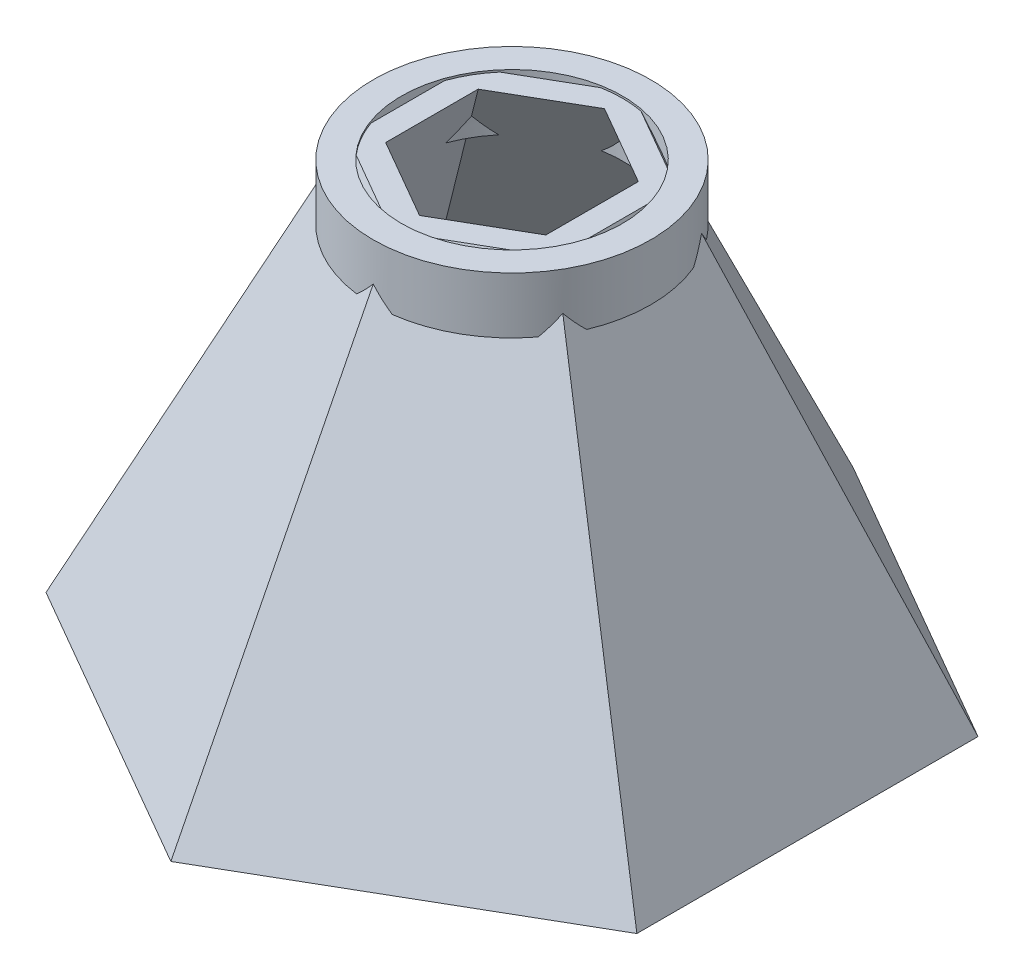
ISO-10303-21;
HEADER;
FILE_DESCRIPTION(('STEP AP214'),'2;1');
FILE_NAME('part.step','',(''),(''),'','','');
FILE_SCHEMA(('AUTOMOTIVE_DESIGN { 1 0 10303 214 1 1 1 1 }'));
ENDSEC;
DATA;
#1=APPLICATION_CONTEXT('core data for automotive mechanical design processes');
#2=APPLICATION_PROTOCOL_DEFINITION('international standard','automotive_design',2000,#1);
#3=PRODUCT_CONTEXT('',#1,'mechanical');
#4=PRODUCT('Part','Part','',(#3));
#5=PRODUCT_RELATED_PRODUCT_CATEGORY('part','',(#4));
#6=PRODUCT_DEFINITION_FORMATION('','',#4);
#7=PRODUCT_DEFINITION_CONTEXT('part definition',#1,'design');
#8=PRODUCT_DEFINITION('design','',#6,#7);
#9=PRODUCT_DEFINITION_SHAPE('','',#8);
#10=(LENGTH_UNIT() NAMED_UNIT(*) SI_UNIT(.MILLI.,.METRE.));
#11=(NAMED_UNIT(*) PLANE_ANGLE_UNIT() SI_UNIT($,.RADIAN.));
#12=(NAMED_UNIT(*) SI_UNIT($,.STERADIAN.) SOLID_ANGLE_UNIT());
#13=UNCERTAINTY_MEASURE_WITH_UNIT(LENGTH_MEASURE(1.E-05),#10,'distance_accuracy_value','');
#14=(GEOMETRIC_REPRESENTATION_CONTEXT(3) GLOBAL_UNCERTAINTY_ASSIGNED_CONTEXT((#13)) GLOBAL_UNIT_ASSIGNED_CONTEXT((#10,
#11,#12)) REPRESENTATION_CONTEXT('',''));
#15=CARTESIAN_POINT('',(0.,0.,0.));
#16=DIRECTION('',(0.,0.,1.));
#17=DIRECTION('',(1.,0.,0.));
#18=AXIS2_PLACEMENT_3D('',#15,#16,#17);
#19=CARTESIAN_POINT('',(0.,-7.112,0.));
#20=DIRECTION('',(0.,1.,0.));
#21=DIRECTION('',(0.,0.,1.));
#22=AXIS2_PLACEMENT_3D('',#19,#20,#21);
#23=PLANE('',#22);
#24=CARTESIAN_POINT('',(0.,-7.112,0.));
#25=DIRECTION('',(0.,1.,0.));
#26=DIRECTION('',(0.,0.,1.));
#27=AXIS2_PLACEMENT_3D('',#24,#25,#26);
#28=CIRCLE('',#27,17.5390809388236);
#29=CARTESIAN_POINT('',(16.1880782558161,-7.112,6.75022092691629));
#30=VERTEX_POINT('',#29);
#31=CARTESIAN_POINT('',(16.1880782558161,-7.112,-6.7502209269163));
#32=VERTEX_POINT('',#31);
#33=EDGE_CURVE('E590',#30,#32,#28,.T.);
#34=ORIENTED_EDGE('',*,*,#33,.F.);
#35=DIRECTION('',(0.,0.,-1.));
#36=VECTOR('',#35,1.);
#37=CARTESIAN_POINT('',(16.1880782558161,-7.112,0.));
#38=LINE('',#37,#36);
#39=EDGE_CURVE('E572',#30,#32,#38,.T.);
#40=ORIENTED_EDGE('',*,*,#39,.T.);
#41=EDGE_LOOP('',(#34,#40));
#42=FACE_BOUND('',#41,.T.);
#43=ADVANCED_FACE('F49',(#42),#23,.F.);
#44=CARTESIAN_POINT('',(2.2481763240412,-7.112,17.3943974714454));
#45=VERTEX_POINT('',#44);
#46=CARTESIAN_POINT('',(13.9399019317749,-7.112,10.6441765445291));
#47=VERTEX_POINT('',#46);
#48=EDGE_CURVE('E586',#45,#47,#28,.T.);
#49=ORIENTED_EDGE('',*,*,#48,.F.);
#50=DIRECTION('',(0.866025403784439,0.,-0.5));
#51=VECTOR('',#50,1.);
#52=CARTESIAN_POINT('',(8.09403912790805,-7.112,14.0192870079872));
#53=LINE('',#52,#51);
#54=EDGE_CURVE('E566',#45,#47,#53,.T.);
#55=ORIENTED_EDGE('',*,*,#54,.T.);
#56=EDGE_LOOP('',(#49,#55));
#57=FACE_BOUND('',#56,.T.);
#58=ADVANCED_FACE('F730',(#57),#23,.F.);
#59=CARTESIAN_POINT('',(13.9399019317749,-7.112,-10.6441765445291));
#60=VERTEX_POINT('',#59);
#61=CARTESIAN_POINT('',(2.2481763240412,-7.112,-17.3943974714454));
#62=VERTEX_POINT('',#61);
#63=EDGE_CURVE('E812',#60,#62,#28,.T.);
#64=ORIENTED_EDGE('',*,*,#63,.F.);
#65=DIRECTION('',(-0.866025403784438,0.,-0.5));
#66=VECTOR('',#65,1.);
#67=CARTESIAN_POINT('',(8.09403912790805,-7.112,-14.0192870079872));
#68=LINE('',#67,#66);
#69=EDGE_CURVE('E560',#60,#62,#68,.T.);
#70=ORIENTED_EDGE('',*,*,#69,.T.);
#71=EDGE_LOOP('',(#64,#70));
#72=FACE_BOUND('',#71,.T.);
#73=ADVANCED_FACE('F737',(#72),#23,.F.);
#74=CARTESIAN_POINT('',(-2.24817632404119,-7.112,-17.3943974714454));
#75=VERTEX_POINT('',#74);
#76=CARTESIAN_POINT('',(-13.9399019317749,-7.112,-10.6441765445291));
#77=VERTEX_POINT('',#76);
#78=EDGE_CURVE('E810',#75,#77,#28,.T.);
#79=ORIENTED_EDGE('',*,*,#78,.F.);
#80=DIRECTION('',(-0.866025403784439,0.,0.5));
#81=VECTOR('',#80,1.);
#82=CARTESIAN_POINT('',(-8.09403912790804,-7.112,-14.0192870079872));
#83=LINE('',#82,#81);
#84=EDGE_CURVE('E554',#75,#77,#83,.T.);
#85=ORIENTED_EDGE('',*,*,#84,.T.);
#86=EDGE_LOOP('',(#79,#85));
#87=FACE_BOUND('',#86,.T.);
#88=ADVANCED_FACE('F799',(#87),#23,.F.);
#89=CARTESIAN_POINT('',(-16.1880782558161,-7.112,-6.7502209269163));
#90=VERTEX_POINT('',#89);
#91=CARTESIAN_POINT('',(-16.1880782558161,-7.112,6.75022092691629));
#92=VERTEX_POINT('',#91);
#93=EDGE_CURVE('E807',#90,#92,#28,.T.);
#94=ORIENTED_EDGE('',*,*,#93,.F.);
#95=DIRECTION('',(0.,0.,1.));
#96=VECTOR('',#95,1.);
#97=CARTESIAN_POINT('',(-16.1880782558161,-7.112,0.));
#98=LINE('',#97,#96);
#99=EDGE_CURVE('E548',#90,#92,#98,.T.);
#100=ORIENTED_EDGE('',*,*,#99,.T.);
#101=EDGE_LOOP('',(#94,#100));
#102=FACE_BOUND('',#101,.T.);
#103=ADVANCED_FACE('F750',(#102),#23,.F.);
#104=CARTESIAN_POINT('',(0.,-7.112,0.));
#105=DIRECTION('',(0.,1.,0.));
#106=DIRECTION('',(0.,0.,1.));
#107=AXIS2_PLACEMENT_3D('',#104,#105,#106);
#108=CYLINDRICAL_SURFACE('',#107,17.5390809388236);
#109=CARTESIAN_POINT('',(0.,29.7290520631807,0.));
#110=DIRECTION('',(0.915516312442047,0.402280849224165,0.));
#111=DIRECTION('',(-0.402280849224165,0.915516312442047,0.));
#112=AXIS2_PLACEMENT_3D('',#109,#110,#111);
#113=ELLIPSE('',#112,43.5990949423748,17.5390809388236);
#114=CARTESIAN_POINT('',(15.1892896520526,-4.83894310159141,8.76954046941178));
#115=VERTEX_POINT('',#114);
#116=EDGE_CURVE('E575',#30,#115,#113,.F.);
#117=ORIENTED_EDGE('',*,*,#116,.F.);
#118=ORIENTED_EDGE('',*,*,#33,.T.);
#119=CARTESIAN_POINT('',(15.1892896520526,-4.83894310159141,-8.76954046941178));
#120=VERTEX_POINT('',#119);
#121=EDGE_CURVE('E577',#120,#32,#113,.F.);
#122=ORIENTED_EDGE('',*,*,#121,.F.);
#123=CARTESIAN_POINT('',(0.,29.7290520631807,0.));
#124=DIRECTION('',(0.457758156221024,0.402280849224166,-0.792860384153864));
#125=DIRECTION('',(-0.201140424612083,0.915516312442047,0.348385434884105));
#126=AXIS2_PLACEMENT_3D('',#123,#124,#125);
#127=ELLIPSE('',#126,43.5990949423748,17.5390809388236);
#128=EDGE_CURVE('E563',#60,#120,#127,.F.);
#129=ORIENTED_EDGE('',*,*,#128,.F.);
#130=ORIENTED_EDGE('',*,*,#63,.T.);
#131=CARTESIAN_POINT('',(0.,-4.83894310159141,-17.5390809388236));
#132=VERTEX_POINT('',#131);
#133=EDGE_CURVE('E565',#132,#62,#127,.F.);
#134=ORIENTED_EDGE('',*,*,#133,.F.);
#135=CARTESIAN_POINT('',(0.,29.7290520631807,0.));
#136=DIRECTION('',(-0.457758156221024,0.402280849224165,-0.792860384153864));
#137=DIRECTION('',(0.201140424612083,0.915516312442047,0.348385434884105));
#138=AXIS2_PLACEMENT_3D('',#135,#136,#137);
#139=ELLIPSE('',#138,43.5990949423748,17.5390809388236);
#140=EDGE_CURVE('E557',#75,#132,#139,.F.);
#141=ORIENTED_EDGE('',*,*,#140,.F.);
#142=ORIENTED_EDGE('',*,*,#78,.T.);
#143=CARTESIAN_POINT('',(-15.1892896520526,-4.83894310159141,-8.76954046941179));
#144=VERTEX_POINT('',#143);
#145=EDGE_CURVE('E559',#144,#77,#139,.F.);
#146=ORIENTED_EDGE('',*,*,#145,.F.);
#147=CARTESIAN_POINT('',(0.,29.7290520631807,0.));
#148=DIRECTION('',(-0.915516312442047,0.402280849224165,0.));
#149=DIRECTION('',(0.402280849224165,0.915516312442048,0.));
#150=AXIS2_PLACEMENT_3D('',#147,#148,#149);
#151=ELLIPSE('',#150,43.5990949423749,17.5390809388236);
#152=EDGE_CURVE('E551',#90,#144,#151,.F.);
#153=ORIENTED_EDGE('',*,*,#152,.F.);
#154=ORIENTED_EDGE('',*,*,#93,.T.);
#155=CARTESIAN_POINT('',(-15.1892896520526,-4.83894310159142,8.76954046941178));
#156=VERTEX_POINT('',#155);
#157=EDGE_CURVE('E553',#156,#92,#151,.F.);
#158=ORIENTED_EDGE('',*,*,#157,.F.);
#159=CARTESIAN_POINT('',(0.,29.7290520631807,0.));
#160=DIRECTION('',(-0.457758156221024,0.402280849224165,0.792860384153864));
#161=DIRECTION('',(0.201140424612083,0.915516312442047,-0.348385434884105));
#162=AXIS2_PLACEMENT_3D('',#159,#160,#161);
#163=ELLIPSE('',#162,43.5990949423749,17.5390809388236);
#164=CARTESIAN_POINT('',(-13.9399019317749,-7.112,10.6441765445291));
#165=VERTEX_POINT('',#164);
#166=EDGE_CURVE('E545',#165,#156,#163,.F.);
#167=ORIENTED_EDGE('',*,*,#166,.F.);
#168=CARTESIAN_POINT('',(-2.2481763240412,-7.112,17.3943974714454));
#169=VERTEX_POINT('',#168);
#170=EDGE_CURVE('E591',#165,#169,#28,.T.);
#171=ORIENTED_EDGE('',*,*,#170,.T.);
#172=CARTESIAN_POINT('',(0.,-4.83894310159139,17.5390809388236));
#173=VERTEX_POINT('',#172);
#174=EDGE_CURVE('E547',#173,#169,#163,.F.);
#175=ORIENTED_EDGE('',*,*,#174,.F.);
#176=CARTESIAN_POINT('',(0.,29.7290520631807,0.));
#177=DIRECTION('',(0.457758156221024,0.402280849224165,0.792860384153864));
#178=DIRECTION('',(-0.201140424612083,0.915516312442047,-0.348385434884105));
#179=AXIS2_PLACEMENT_3D('',#176,#177,#178);
#180=ELLIPSE('',#179,43.5990949423748,17.5390809388236);
#181=EDGE_CURVE('E569',#45,#173,#180,.F.);
#182=ORIENTED_EDGE('',*,*,#181,.F.);
#183=ORIENTED_EDGE('',*,*,#48,.T.);
#184=EDGE_CURVE('E571',#115,#47,#180,.F.);
#185=ORIENTED_EDGE('',*,*,#184,.F.);
#186=EDGE_LOOP('',(#117,#118,#122,#129,#130,#134,#141,#142,#146,#153,#154,#158,#167,#171,#175,
#182,#183,#185));
#187=FACE_BOUND('',#186,.T.);
#188=CARTESIAN_POINT('',(0.,0.,0.));
#189=DIRECTION('',(0.,1.,0.));
#190=DIRECTION('',(0.,0.,1.));
#191=AXIS2_PLACEMENT_3D('',#188,#189,#190);
#192=CIRCLE('',#191,17.5390809388236);
#193=CARTESIAN_POINT('',(0.,0.,17.5390809388236));
#194=VERTEX_POINT('',#193);
#195=EDGE_CURVE('E592',#194,#194,#192,.T.);
#196=ORIENTED_EDGE('',*,*,#195,.F.);
#197=EDGE_LOOP('',(#196));
#198=FACE_BOUND('',#197,.T.);
#199=ADVANCED_FACE('F51',(#187,#198),#108,.T.);
#200=ORIENTED_EDGE('',*,*,#170,.F.);
#201=DIRECTION('',(0.866025403784438,0.,0.5));
#202=VECTOR('',#201,1.);
#203=CARTESIAN_POINT('',(-8.09403912790804,-7.112,14.0192870079872));
#204=LINE('',#203,#202);
#205=EDGE_CURVE('E541',#165,#169,#204,.T.);
#206=ORIENTED_EDGE('',*,*,#205,.T.);
#207=EDGE_LOOP('',(#200,#206));
#208=FACE_BOUND('',#207,.T.);
#209=ADVANCED_FACE('F733',(#208),#23,.F.);
#210=CARTESIAN_POINT('',(0.,0.,0.));
#211=DIRECTION('',(0.,1.,0.));
#212=DIRECTION('',(0.,0.,1.));
#213=AXIS2_PLACEMENT_3D('',#210,#211,#212);
#214=PLANE('',#213);
#215=CARTESIAN_POINT('',(0.,0.,0.));
#216=DIRECTION('',(0.,1.,0.));
#217=DIRECTION('',(0.,0.,1.));
#218=AXIS2_PLACEMENT_3D('',#215,#216,#217);
#219=CIRCLE('',#218,13.97);
#220=CARTESIAN_POINT('',(0.,0.,13.97));
#221=VERTEX_POINT('',#220);
#222=EDGE_CURVE('E582',#221,#221,#219,.T.);
#223=ORIENTED_EDGE('',*,*,#222,.F.);
#224=EDGE_LOOP('',(#223));
#225=FACE_BOUND('',#224,.T.);
#226=ORIENTED_EDGE('',*,*,#195,.T.);
#227=EDGE_LOOP('',(#226));
#228=FACE_BOUND('',#227,.T.);
#229=ADVANCED_FACE('F742',(#225,#228),#214,.T.);
#230=CARTESIAN_POINT('',(0.,-7.112,0.));
#231=DIRECTION('',(0.,1.,0.));
#232=DIRECTION('',(0.,0.,1.));
#233=AXIS2_PLACEMENT_3D('',#230,#231,#232);
#234=CYLINDRICAL_SURFACE('',#233,13.97);
#235=CARTESIAN_POINT('',(0.,-0.254,0.));
#236=DIRECTION('',(0.,-1.,0.));
#237=DIRECTION('',(0.,0.,-1.));
#238=AXIS2_PLACEMENT_3D('',#235,#236,#237);
#239=CIRCLE('',#238,13.97);
#240=CARTESIAN_POINT('',(2.56338341614084,-0.254,-13.7328061757914));
#241=VERTEX_POINT('',#240);
#242=CARTESIAN_POINT('',(-2.56338341614084,-0.254,-13.7328061757914));
#243=VERTEX_POINT('',#242);
#244=EDGE_CURVE('E634',#241,#243,#239,.F.);
#245=ORIENTED_EDGE('',*,*,#244,.F.);
#246=CARTESIAN_POINT('',(0.,29.7290520631807,0.));
#247=DIRECTION('',(0.457758156221024,0.402280849224166,-0.792860384153864));
#248=DIRECTION('',(-0.201140424612083,0.915516312442047,0.348385434884105));
#249=AXIS2_PLACEMENT_3D('',#246,#247,#248);
#250=ELLIPSE('',#249,34.7269824724254,13.97);
#251=CARTESIAN_POINT('',(10.6112673054128,-0.254,-9.0863582459134));
#252=VERTEX_POINT('',#251);
#253=EDGE_CURVE('E12',#241,#252,#250,.F.);
#254=ORIENTED_EDGE('',*,*,#253,.T.);
#255=CARTESIAN_POINT('',(13.1746507215536,-0.254,-4.646447929878));
#256=VERTEX_POINT('',#255);
#257=EDGE_CURVE('E57',#256,#252,#239,.F.);
#258=ORIENTED_EDGE('',*,*,#257,.F.);
#259=CARTESIAN_POINT('',(0.,29.7290520631807,0.));
#260=DIRECTION('',(0.915516312442047,0.402280849224165,0.));
#261=DIRECTION('',(-0.402280849224165,0.915516312442047,0.));
#262=AXIS2_PLACEMENT_3D('',#259,#260,#261);
#263=ELLIPSE('',#262,34.7269824724254,13.97);
#264=CARTESIAN_POINT('',(13.1746507215536,-0.254,4.64644792987799));
#265=VERTEX_POINT('',#264);
#266=EDGE_CURVE('E631',#256,#265,#263,.F.);
#267=ORIENTED_EDGE('',*,*,#266,.T.);
#268=CARTESIAN_POINT('',(10.6112673054127,-0.254,9.0863582459134));
#269=VERTEX_POINT('',#268);
#270=EDGE_CURVE('E628',#269,#265,#239,.F.);
#271=ORIENTED_EDGE('',*,*,#270,.F.);
#272=CARTESIAN_POINT('',(0.,29.7290520631807,0.));
#273=DIRECTION('',(0.457758156221024,0.402280849224165,0.792860384153864));
#274=DIRECTION('',(-0.201140424612083,0.915516312442047,-0.348385434884105));
#275=AXIS2_PLACEMENT_3D('',#272,#273,#274);
#276=ELLIPSE('',#275,34.7269824724254,13.97);
#277=CARTESIAN_POINT('',(2.56338341614085,-0.254,13.7328061757914));
#278=VERTEX_POINT('',#277);
#279=EDGE_CURVE('E625',#269,#278,#276,.F.);
#280=ORIENTED_EDGE('',*,*,#279,.T.);
#281=CARTESIAN_POINT('',(-2.56338341614085,-0.254,13.7328061757914));
#282=VERTEX_POINT('',#281);
#283=EDGE_CURVE('E619',#282,#278,#239,.F.);
#284=ORIENTED_EDGE('',*,*,#283,.F.);
#285=CARTESIAN_POINT('',(0.,29.7290520631807,0.));
#286=DIRECTION('',(-0.457758156221024,0.402280849224165,0.792860384153864));
#287=DIRECTION('',(0.201140424612083,0.915516312442047,-0.348385434884105));
#288=AXIS2_PLACEMENT_3D('',#285,#286,#287);
#289=ELLIPSE('',#288,34.7269824724254,13.97);
#290=CARTESIAN_POINT('',(-10.6112673054127,-0.254,9.0863582459134));
#291=VERTEX_POINT('',#290);
#292=EDGE_CURVE('E616',#282,#291,#289,.F.);
#293=ORIENTED_EDGE('',*,*,#292,.T.);
#294=CARTESIAN_POINT('',(-13.1746507215536,-0.254,4.64644792987797));
#295=VERTEX_POINT('',#294);
#296=EDGE_CURVE('E621',#295,#291,#239,.F.);
#297=ORIENTED_EDGE('',*,*,#296,.F.);
#298=CARTESIAN_POINT('',(0.,29.7290520631807,0.));
#299=DIRECTION('',(-0.915516312442047,0.402280849224165,0.));
#300=DIRECTION('',(0.402280849224165,0.915516312442048,0.));
#301=AXIS2_PLACEMENT_3D('',#298,#299,#300);
#302=ELLIPSE('',#301,34.7269824724254,13.97);
#303=CARTESIAN_POINT('',(-13.1746507215536,-0.254,-4.64644792987799));
#304=VERTEX_POINT('',#303);
#305=EDGE_CURVE('E622',#295,#304,#302,.F.);
#306=ORIENTED_EDGE('',*,*,#305,.T.);
#307=CARTESIAN_POINT('',(-10.6112673054128,-0.254,-9.0863582459134));
#308=VERTEX_POINT('',#307);
#309=EDGE_CURVE('E632',#308,#304,#239,.F.);
#310=ORIENTED_EDGE('',*,*,#309,.F.);
#311=CARTESIAN_POINT('',(0.,29.7290520631807,0.));
#312=DIRECTION('',(-0.457758156221024,0.402280849224165,-0.792860384153864));
#313=DIRECTION('',(0.201140424612083,0.915516312442047,0.348385434884105));
#314=AXIS2_PLACEMENT_3D('',#311,#312,#313);
#315=ELLIPSE('',#314,34.7269824724254,13.97);
#316=EDGE_CURVE('E629',#308,#243,#315,.F.);
#317=ORIENTED_EDGE('',*,*,#316,.T.);
#318=EDGE_LOOP('',(#245,#254,#258,#267,#271,#280,#284,#293,#297,#306,#310,#317));
#319=FACE_BOUND('',#318,.T.);
#320=ORIENTED_EDGE('',*,*,#222,.T.);
#321=EDGE_LOOP('',(#320));
#322=FACE_BOUND('',#321,.T.);
#323=ADVANCED_FACE('F655',(#319,#322),#234,.F.);
#324=CARTESIAN_POINT('',(0.,-0.254,0.));
#325=DIRECTION('',(0.,-1.,0.));
#326=DIRECTION('',(0.,0.,-1.));
#327=AXIS2_PLACEMENT_3D('',#324,#325,#326);
#328=PLANE('',#327);
#329=DIRECTION('',(-0.866025403784438,0.,-0.5));
#330=VECTOR('',#329,1.);
#331=CARTESIAN_POINT('',(0.,-0.254,11.6888267235082));
#332=LINE('',#331,#330);
#333=CARTESIAN_POINT('',(0.,-0.254,11.6888267235082));
#334=VERTEX_POINT('',#333);
#335=CARTESIAN_POINT('',(-10.1228208829926,-0.254,5.84441336175412));
#336=VERTEX_POINT('',#335);
#337=EDGE_CURVE('E314',#334,#336,#332,.T.);
#338=ORIENTED_EDGE('',*,*,#337,.T.);
#339=DIRECTION('',(0.,0.,-1.));
#340=VECTOR('',#339,1.);
#341=CARTESIAN_POINT('',(-10.1228208829926,-0.254,5.84441336175412));
#342=LINE('',#341,#340);
#343=CARTESIAN_POINT('',(-10.1228208829926,-0.254,-5.84441336175413));
#344=VERTEX_POINT('',#343);
#345=EDGE_CURVE('E423',#336,#344,#342,.T.);
#346=ORIENTED_EDGE('',*,*,#345,.T.);
#347=DIRECTION('',(0.866025403784439,0.,-0.5));
#348=VECTOR('',#347,1.);
#349=CARTESIAN_POINT('',(-10.1228208829926,-0.254,-5.84441336175413));
#350=LINE('',#349,#348);
#351=CARTESIAN_POINT('',(0.,-0.254,-11.6888267235083));
#352=VERTEX_POINT('',#351);
#353=EDGE_CURVE('E420',#344,#352,#350,.T.);
#354=ORIENTED_EDGE('',*,*,#353,.T.);
#355=DIRECTION('',(0.866025403784439,0.,0.5));
#356=VECTOR('',#355,1.);
#357=CARTESIAN_POINT('',(0.,-0.254,-11.6888267235083));
#358=LINE('',#357,#356);
#359=CARTESIAN_POINT('',(10.1228208829926,-0.254,-5.84441336175412));
#360=VERTEX_POINT('',#359);
#361=EDGE_CURVE('E410',#352,#360,#358,.T.);
#362=ORIENTED_EDGE('',*,*,#361,.T.);
#363=DIRECTION('',(0.,0.,1.));
#364=VECTOR('',#363,1.);
#365=CARTESIAN_POINT('',(10.1228208829926,-0.254,-5.84441336175412));
#366=LINE('',#365,#364);
#367=CARTESIAN_POINT('',(10.1228208829926,-0.254,5.84441336175412));
#368=VERTEX_POINT('',#367);
#369=EDGE_CURVE('E406',#360,#368,#366,.T.);
#370=ORIENTED_EDGE('',*,*,#369,.T.);
#371=DIRECTION('',(-0.866025403784439,0.,0.5));
#372=VECTOR('',#371,1.);
#373=CARTESIAN_POINT('',(10.1228208829926,-0.254,5.84441336175412));
#374=LINE('',#373,#372);
#375=EDGE_CURVE('E401',#368,#334,#374,.T.);
#376=ORIENTED_EDGE('',*,*,#375,.T.);
#377=EDGE_LOOP('',(#338,#346,#354,#362,#370,#376));
#378=FACE_BOUND('',#377,.T.);
#379=DIRECTION('',(0.866025403784439,0.,-0.5));
#380=VECTOR('',#379,1.);
#381=CARTESIAN_POINT('',(-6.5873253607768,-0.254,-11.4095822108524));
#382=LINE('',#381,#380);
#383=EDGE_CURVE('E660',#308,#243,#382,.T.);
#384=ORIENTED_EDGE('',*,*,#383,.F.);
#385=ORIENTED_EDGE('',*,*,#309,.T.);
#386=DIRECTION('',(0.,0.,-1.));
#387=VECTOR('',#386,1.);
#388=CARTESIAN_POINT('',(-13.1746507215536,-0.254,0.));
#389=LINE('',#388,#387);
#390=EDGE_CURVE('E654',#295,#304,#389,.T.);
#391=ORIENTED_EDGE('',*,*,#390,.F.);
#392=ORIENTED_EDGE('',*,*,#296,.T.);
#393=DIRECTION('',(-0.866025403784438,0.,-0.5));
#394=VECTOR('',#393,1.);
#395=CARTESIAN_POINT('',(-6.5873253607768,-0.254,11.4095822108524));
#396=LINE('',#395,#394);
#397=EDGE_CURVE('E652',#282,#291,#396,.T.);
#398=ORIENTED_EDGE('',*,*,#397,.F.);
#399=ORIENTED_EDGE('',*,*,#283,.T.);
#400=DIRECTION('',(-0.866025403784439,0.,0.5));
#401=VECTOR('',#400,1.);
#402=CARTESIAN_POINT('',(6.5873253607768,-0.254,11.4095822108524));
#403=LINE('',#402,#401);
#404=EDGE_CURVE('E667',#269,#278,#403,.T.);
#405=ORIENTED_EDGE('',*,*,#404,.F.);
#406=ORIENTED_EDGE('',*,*,#270,.T.);
#407=DIRECTION('',(0.,0.,1.));
#408=VECTOR('',#407,1.);
#409=CARTESIAN_POINT('',(13.1746507215536,-0.254,0.));
#410=LINE('',#409,#408);
#411=EDGE_CURVE('E671',#256,#265,#410,.T.);
#412=ORIENTED_EDGE('',*,*,#411,.F.);
#413=ORIENTED_EDGE('',*,*,#257,.T.);
#414=DIRECTION('',(0.866025403784438,0.,0.5));
#415=VECTOR('',#414,1.);
#416=CARTESIAN_POINT('',(6.5873253607768,-0.254,-11.4095822108524));
#417=LINE('',#416,#415);
#418=EDGE_CURVE('E710',#241,#252,#417,.T.);
#419=ORIENTED_EDGE('',*,*,#418,.F.);
#420=ORIENTED_EDGE('',*,*,#244,.T.);
#421=EDGE_LOOP('',(#384,#385,#391,#392,#398,#399,#405,#406,#412,#413,#419,#420));
#422=FACE_BOUND('',#421,.T.);
#423=ADVANCED_FACE('F347',(#378,#422),#328,.F.);
#424=CARTESIAN_POINT('',(10.9490517058408,4.81104897702601,0.));
#425=DIRECTION('',(0.915516312442047,0.402280849224165,0.));
#426=DIRECTION('',(-0.402280849224165,0.915516312442047,0.));
#427=AXIS2_PLACEMENT_3D('',#424,#425,#426);
#428=PLANE('',#427);
#429=ORIENTED_EDGE('',*,*,#266,.F.);
#430=ORIENTED_EDGE('',*,*,#411,.T.);
#431=EDGE_LOOP('',(#429,#430));
#432=FACE_BOUND('',#431,.T.);
#433=ADVANCED_FACE('F880',(#432),#428,.T.);
#434=CARTESIAN_POINT('',(5.47452585292041,4.81104897702601,9.48215692460749));
#435=DIRECTION('',(0.457758156221024,0.402280849224165,0.792860384153864));
#436=DIRECTION('',(0.866025403784439,0.,-0.5));
#437=AXIS2_PLACEMENT_3D('',#434,#435,#436);
#438=PLANE('',#437);
#439=ORIENTED_EDGE('',*,*,#279,.F.);
#440=ORIENTED_EDGE('',*,*,#404,.T.);
#441=EDGE_LOOP('',(#439,#440));
#442=FACE_BOUND('',#441,.T.);
#443=ADVANCED_FACE('F890',(#442),#438,.T.);
#444=CARTESIAN_POINT('',(5.47452585292041,4.81104897702601,-9.48215692460748));
#445=DIRECTION('',(0.457758156221024,0.402280849224166,-0.792860384153864));
#446=DIRECTION('',(-0.866025403784438,0.,-0.5));
#447=AXIS2_PLACEMENT_3D('',#444,#445,#446);
#448=PLANE('',#447);
#449=ORIENTED_EDGE('',*,*,#253,.F.);
#450=ORIENTED_EDGE('',*,*,#418,.T.);
#451=EDGE_LOOP('',(#449,#450));
#452=FACE_BOUND('',#451,.T.);
#453=ADVANCED_FACE('F725',(#452),#448,.T.);
#454=CARTESIAN_POINT('',(-5.47452585292041,4.81104897702601,-9.48215692460749));
#455=DIRECTION('',(-0.457758156221024,0.402280849224165,-0.792860384153864));
#456=DIRECTION('',(-0.866025403784439,0.,0.5));
#457=AXIS2_PLACEMENT_3D('',#454,#455,#456);
#458=PLANE('',#457);
#459=ORIENTED_EDGE('',*,*,#316,.F.);
#460=ORIENTED_EDGE('',*,*,#383,.T.);
#461=EDGE_LOOP('',(#459,#460));
#462=FACE_BOUND('',#461,.T.);
#463=ADVANCED_FACE('F713',(#462),#458,.T.);
#464=CARTESIAN_POINT('',(-10.9490517058408,4.81104897702601,0.));
#465=DIRECTION('',(-0.915516312442047,0.402280849224165,0.));
#466=DIRECTION('',(-0.402280849224165,-0.915516312442048,0.));
#467=AXIS2_PLACEMENT_3D('',#464,#465,#466);
#468=PLANE('',#467);
#469=ORIENTED_EDGE('',*,*,#305,.F.);
#470=ORIENTED_EDGE('',*,*,#390,.T.);
#471=EDGE_LOOP('',(#469,#470));
#472=FACE_BOUND('',#471,.T.);
#473=ADVANCED_FACE('F715',(#472),#468,.T.);
#474=CARTESIAN_POINT('',(-5.47452585292041,4.81104897702601,9.48215692460748));
#475=DIRECTION('',(-0.457758156221024,0.402280849224165,0.792860384153864));
#476=DIRECTION('',(0.866025403784438,0.,0.5));
#477=AXIS2_PLACEMENT_3D('',#474,#475,#476);
#478=PLANE('',#477);
#479=ORIENTED_EDGE('',*,*,#292,.F.);
#480=ORIENTED_EDGE('',*,*,#397,.T.);
#481=EDGE_LOOP('',(#479,#480));
#482=FACE_BOUND('',#481,.T.);
#483=ADVANCED_FACE('F451',(#482),#478,.T.);
#484=CARTESIAN_POINT('',(8.39109912887773,3.6870762842937,0.));
#485=DIRECTION('',(0.915516312442047,0.402280849224165,0.));
#486=DIRECTION('',(-0.402280849224165,0.915516312442047,0.));
#487=AXIS2_PLACEMENT_3D('',#484,#485,#486);
#488=PLANE('',#487);
#489=CARTESIAN_POINT('',(0.,22.7836555686956,0.));
#490=DIRECTION('',(0.915516312442047,0.402280849224165,0.));
#491=DIRECTION('',(-0.402280849224165,0.915516312442047,0.));
#492=AXIS2_PLACEMENT_3D('',#489,#490,#491);
#493=ELLIPSE('',#492,34.7269824724254,13.97);
#494=CARTESIAN_POINT('',(12.0983748908686,-4.74999309489612,-6.98500000000001));
#495=VERTEX_POINT('',#494);
#496=CARTESIAN_POINT('',(13.1362484172551,-7.112,-4.75393284767088));
#497=VERTEX_POINT('',#496);
#498=EDGE_CURVE('E614',#495,#497,#493,.F.);
#499=ORIENTED_EDGE('',*,*,#498,.T.);
#500=DIRECTION('',(0.,0.,-1.));
#501=VECTOR('',#500,1.);
#502=CARTESIAN_POINT('',(13.1362484172551,-7.112,0.));
#503=LINE('',#502,#501);
#504=CARTESIAN_POINT('',(13.1362484172551,-7.112,-7.584216559844));
#505=VERTEX_POINT('',#504);
#506=EDGE_CURVE('E539',#497,#505,#503,.T.);
#507=ORIENTED_EDGE('',*,*,#506,.T.);
#508=DIRECTION('',(-0.391850798278128,0.891779458452813,0.226235163868047));
#509=VECTOR('',#508,1.);
#510=CARTESIAN_POINT('',(34.29,-55.254,-19.7973407305123));
#511=LINE('',#510,#509);
#512=CARTESIAN_POINT('',(34.29,-55.254,-19.7973407305123));
#513=VERTEX_POINT('',#512);
#514=EDGE_CURVE('E440',#513,#505,#511,.T.);
#515=ORIENTED_EDGE('',*,*,#514,.F.);
#516=DIRECTION('',(0.,0.,1.));
#517=VECTOR('',#516,1.);
#518=CARTESIAN_POINT('',(34.29,-55.254,-19.7973407305123));
#519=LINE('',#518,#517);
#520=CARTESIAN_POINT('',(34.29,-55.254,19.7973407305123));
#521=VERTEX_POINT('',#520);
#522=EDGE_CURVE('E300',#513,#521,#519,.T.);
#523=ORIENTED_EDGE('',*,*,#522,.T.);
#524=DIRECTION('',(-0.391850798278128,0.891779458452813,-0.226235163868047));
#525=VECTOR('',#524,1.);
#526=CARTESIAN_POINT('',(34.29,-55.254,19.7973407305123));
#527=LINE('',#526,#525);
#528=CARTESIAN_POINT('',(13.1362484172551,-7.112,7.584216559844));
#529=VERTEX_POINT('',#528);
#530=EDGE_CURVE('E294',#521,#529,#527,.T.);
#531=ORIENTED_EDGE('',*,*,#530,.T.);
#532=CARTESIAN_POINT('',(13.1362484172551,-7.112,4.75393284767087));
#533=VERTEX_POINT('',#532);
#534=EDGE_CURVE('E64',#529,#533,#503,.T.);
#535=ORIENTED_EDGE('',*,*,#534,.T.);
#536=CARTESIAN_POINT('',(12.0983748908686,-4.74999309489606,6.98499999999999));
#537=VERTEX_POINT('',#536);
#538=EDGE_CURVE('E537',#533,#537,#493,.F.);
#539=ORIENTED_EDGE('',*,*,#538,.T.);
#540=EDGE_CURVE('E521',#537,#368,#527,.T.);
#541=ORIENTED_EDGE('',*,*,#540,.T.);
#542=ORIENTED_EDGE('',*,*,#369,.F.);
#543=EDGE_CURVE('E299',#495,#360,#511,.T.);
#544=ORIENTED_EDGE('',*,*,#543,.F.);
#545=EDGE_LOOP('',(#499,#507,#515,#523,#531,#535,#539,#541,#542,#544));
#546=FACE_BOUND('',#545,.T.);
#547=ADVANCED_FACE('F442',(#546),#488,.F.);
#548=CARTESIAN_POINT('',(4.19554956443887,3.6870762842937,7.26690501128159));
#549=DIRECTION('',(0.457758156221024,0.402280849224165,0.792860384153864));
#550=DIRECTION('',(0.866025403784439,0.,-0.5));
#551=AXIS2_PLACEMENT_3D('',#548,#549,#550);
#552=PLANE('',#551);
#553=CARTESIAN_POINT('',(0.,22.7836555686956,0.));
#554=DIRECTION('',(0.457758156221024,0.402280849224165,0.792860384153864));
#555=DIRECTION('',(-0.201140424612083,0.915516312442047,-0.348385434884105));
#556=AXIS2_PLACEMENT_3D('',#553,#554,#555);
#557=ELLIPSE('',#556,34.7269824724254,13.97);
#558=CARTESIAN_POINT('',(10.6851508225958,-7.112,8.99935841593057));
#559=VERTEX_POINT('',#558);
#560=EDGE_CURVE('E605',#537,#559,#557,.F.);
#561=ORIENTED_EDGE('',*,*,#560,.T.);
#562=DIRECTION('',(0.866025403784439,0.,-0.5));
#563=VECTOR('',#562,1.);
#564=CARTESIAN_POINT('',(6.56812420862753,-7.112,11.376324839766));
#565=LINE('',#564,#563);
#566=EDGE_CURVE('E540',#559,#529,#565,.T.);
#567=ORIENTED_EDGE('',*,*,#566,.T.);
#568=ORIENTED_EDGE('',*,*,#530,.F.);
#569=DIRECTION('',(-0.866025403784439,0.,0.5));
#570=VECTOR('',#569,1.);
#571=CARTESIAN_POINT('',(34.29,-55.254,19.7973407305123));
#572=LINE('',#571,#570);
#573=CARTESIAN_POINT('',(0.,-55.254,39.5946814610245));
#574=VERTEX_POINT('',#573);
#575=EDGE_CURVE('E286',#521,#574,#572,.T.);
#576=ORIENTED_EDGE('',*,*,#575,.T.);
#577=DIRECTION('',(0.,0.891779458452813,-0.452470327736093));
#578=VECTOR('',#577,1.);
#579=CARTESIAN_POINT('',(0.,-55.254,39.5946814610245));
#580=LINE('',#579,#578);
#581=CARTESIAN_POINT('',(0.,-7.112,15.168433119688));
#582=VERTEX_POINT('',#581);
#583=EDGE_CURVE('E292',#574,#582,#580,.T.);
#584=ORIENTED_EDGE('',*,*,#583,.T.);
#585=CARTESIAN_POINT('',(2.45109759465927,-7.112,13.7532912636014));
#586=VERTEX_POINT('',#585);
#587=EDGE_CURVE('E523',#582,#586,#565,.T.);
#588=ORIENTED_EDGE('',*,*,#587,.T.);
#589=CARTESIAN_POINT('',(0.,-4.74999309489609,13.97));
#590=VERTEX_POINT('',#589);
#591=EDGE_CURVE('E602',#586,#590,#557,.F.);
#592=ORIENTED_EDGE('',*,*,#591,.T.);
#593=EDGE_CURVE('E315',#590,#334,#580,.T.);
#594=ORIENTED_EDGE('',*,*,#593,.T.);
#595=ORIENTED_EDGE('',*,*,#375,.F.);
#596=ORIENTED_EDGE('',*,*,#540,.F.);
#597=EDGE_LOOP('',(#561,#567,#568,#576,#584,#588,#592,#594,#595,#596));
#598=FACE_BOUND('',#597,.T.);
#599=ADVANCED_FACE('F290',(#598),#552,.F.);
#600=CARTESIAN_POINT('',(4.19554956443887,3.6870762842937,-7.26690501128159));
#601=DIRECTION('',(0.457758156221024,0.402280849224166,-0.792860384153864));
#602=DIRECTION('',(-0.866025403784438,0.,-0.5));
#603=AXIS2_PLACEMENT_3D('',#600,#601,#602);
#604=PLANE('',#603);
#605=CARTESIAN_POINT('',(0.,22.7836555686956,0.));
#606=DIRECTION('',(0.457758156221024,0.402280849224166,-0.792860384153864));
#607=DIRECTION('',(-0.201140424612083,0.915516312442047,0.348385434884105));
#608=AXIS2_PLACEMENT_3D('',#605,#606,#607);
#609=ELLIPSE('',#608,34.7269824724254,13.97);
#610=CARTESIAN_POINT('',(0.,-4.7499930948961,-13.97));
#611=VERTEX_POINT('',#610);
#612=CARTESIAN_POINT('',(2.45109759465925,-7.112,-13.7532912636014));
#613=VERTEX_POINT('',#612);
#614=EDGE_CURVE('E610',#611,#613,#609,.F.);
#615=ORIENTED_EDGE('',*,*,#614,.T.);
#616=DIRECTION('',(-0.866025403784438,0.,-0.5));
#617=VECTOR('',#616,1.);
#618=CARTESIAN_POINT('',(6.56812420862753,-7.112,-11.376324839766));
#619=LINE('',#618,#617);
#620=CARTESIAN_POINT('',(0.,-7.11200000000001,-15.168433119688));
#621=VERTEX_POINT('',#620);
#622=EDGE_CURVE('E520',#613,#621,#619,.T.);
#623=ORIENTED_EDGE('',*,*,#622,.T.);
#624=DIRECTION('',(0.,0.891779458452813,0.452470327736094));
#625=VECTOR('',#624,1.);
#626=CARTESIAN_POINT('',(0.,-55.254,-39.5946814610245));
#627=LINE('',#626,#625);
#628=CARTESIAN_POINT('',(0.,-55.254,-39.5946814610245));
#629=VERTEX_POINT('',#628);
#630=EDGE_CURVE('E494',#629,#621,#627,.T.);
#631=ORIENTED_EDGE('',*,*,#630,.F.);
#632=DIRECTION('',(0.866025403784439,0.,0.5));
#633=VECTOR('',#632,1.);
#634=CARTESIAN_POINT('',(0.,-55.254,-39.5946814610245));
#635=LINE('',#634,#633);
#636=EDGE_CURVE('E379',#629,#513,#635,.T.);
#637=ORIENTED_EDGE('',*,*,#636,.T.);
#638=ORIENTED_EDGE('',*,*,#514,.T.);
#639=CARTESIAN_POINT('',(10.6851508225958,-7.112,-8.99935841593056));
#640=VERTEX_POINT('',#639);
#641=EDGE_CURVE('E72',#505,#640,#619,.T.);
#642=ORIENTED_EDGE('',*,*,#641,.T.);
#643=EDGE_CURVE('E613',#640,#495,#609,.F.);
#644=ORIENTED_EDGE('',*,*,#643,.T.);
#645=ORIENTED_EDGE('',*,*,#543,.T.);
#646=ORIENTED_EDGE('',*,*,#361,.F.);
#647=EDGE_CURVE('E502',#611,#352,#627,.T.);
#648=ORIENTED_EDGE('',*,*,#647,.F.);
#649=EDGE_LOOP('',(#615,#623,#631,#637,#638,#642,#644,#645,#646,#648));
#650=FACE_BOUND('',#649,.T.);
#651=ADVANCED_FACE('F477',(#650),#604,.F.);
#652=CARTESIAN_POINT('',(-4.19554956443887,3.6870762842937,-7.26690501128159));
#653=DIRECTION('',(-0.457758156221024,0.402280849224165,-0.792860384153864));
#654=DIRECTION('',(-0.866025403784439,0.,0.5));
#655=AXIS2_PLACEMENT_3D('',#652,#653,#654);
#656=PLANE('',#655);
#657=CARTESIAN_POINT('',(0.,22.7836555686956,0.));
#658=DIRECTION('',(-0.457758156221024,0.402280849224165,-0.792860384153864));
#659=DIRECTION('',(0.201140424612083,0.915516312442047,0.348385434884105));
#660=AXIS2_PLACEMENT_3D('',#657,#658,#659);
#661=ELLIPSE('',#660,34.7269824724254,13.97);
#662=CARTESIAN_POINT('',(-12.0983748908686,-4.74999309489613,-6.98500000000002));
#663=VERTEX_POINT('',#662);
#664=CARTESIAN_POINT('',(-10.6851508225958,-7.112,-8.99935841593057));
#665=VERTEX_POINT('',#664);
#666=EDGE_CURVE('E606',#663,#665,#661,.F.);
#667=ORIENTED_EDGE('',*,*,#666,.T.);
#668=DIRECTION('',(-0.866025403784439,0.,0.5));
#669=VECTOR('',#668,1.);
#670=CARTESIAN_POINT('',(-6.56812420862753,-7.112,-11.376324839766));
#671=LINE('',#670,#669);
#672=CARTESIAN_POINT('',(-13.1362484172551,-7.112,-7.58421655984401));
#673=VERTEX_POINT('',#672);
#674=EDGE_CURVE('E514',#665,#673,#671,.T.);
#675=ORIENTED_EDGE('',*,*,#674,.T.);
#676=DIRECTION('',(0.391850798278127,0.891779458452813,0.226235163868047));
#677=VECTOR('',#676,1.);
#678=CARTESIAN_POINT('',(-34.29,-55.254,-19.7973407305123));
#679=LINE('',#678,#677);
#680=CARTESIAN_POINT('',(-34.29,-55.254,-19.7973407305123));
#681=VERTEX_POINT('',#680);
#682=EDGE_CURVE('E1178',#681,#673,#679,.T.);
#683=ORIENTED_EDGE('',*,*,#682,.F.);
#684=DIRECTION('',(0.866025403784439,0.,-0.5));
#685=VECTOR('',#684,1.);
#686=CARTESIAN_POINT('',(-34.29,-55.254,-19.7973407305123));
#687=LINE('',#686,#685);
#688=EDGE_CURVE('E377',#681,#629,#687,.T.);
#689=ORIENTED_EDGE('',*,*,#688,.T.);
#690=ORIENTED_EDGE('',*,*,#630,.T.);
#691=CARTESIAN_POINT('',(-2.45109759465924,-7.112,-13.7532912636014));
#692=VERTEX_POINT('',#691);
#693=EDGE_CURVE('E511',#621,#692,#671,.T.);
#694=ORIENTED_EDGE('',*,*,#693,.T.);
#695=EDGE_CURVE('E609',#692,#611,#661,.F.);
#696=ORIENTED_EDGE('',*,*,#695,.T.);
#697=ORIENTED_EDGE('',*,*,#647,.T.);
#698=ORIENTED_EDGE('',*,*,#353,.F.);
#699=EDGE_CURVE('E501',#663,#344,#679,.T.);
#700=ORIENTED_EDGE('',*,*,#699,.F.);
#701=EDGE_LOOP('',(#667,#675,#683,#689,#690,#694,#696,#697,#698,#700));
#702=FACE_BOUND('',#701,.T.);
#703=ADVANCED_FACE('F486',(#702),#656,.F.);
#704=CARTESIAN_POINT('',(-8.39109912887774,3.68707628429369,0.));
#705=DIRECTION('',(-0.915516312442047,0.402280849224165,0.));
#706=DIRECTION('',(-0.402280849224165,-0.915516312442048,0.));
#707=AXIS2_PLACEMENT_3D('',#704,#705,#706);
#708=PLANE('',#707);
#709=CARTESIAN_POINT('',(0.,22.7836555686957,0.));
#710=DIRECTION('',(-0.915516312442047,0.402280849224165,0.));
#711=DIRECTION('',(0.402280849224165,0.915516312442048,0.));
#712=AXIS2_PLACEMENT_3D('',#709,#710,#711);
#713=ELLIPSE('',#712,34.7269824724254,13.97);
#714=CARTESIAN_POINT('',(-12.0983748908686,-4.74999309489608,6.98499999999999));
#715=VERTEX_POINT('',#714);
#716=CARTESIAN_POINT('',(-13.1362484172551,-7.112,4.75393284767087));
#717=VERTEX_POINT('',#716);
#718=EDGE_CURVE('E597',#715,#717,#713,.F.);
#719=ORIENTED_EDGE('',*,*,#718,.T.);
#720=DIRECTION('',(0.,0.,1.));
#721=VECTOR('',#720,1.);
#722=CARTESIAN_POINT('',(-13.1362484172551,-7.112,0.));
#723=LINE('',#722,#721);
#724=CARTESIAN_POINT('',(-13.1362484172551,-7.112,7.584216559844));
#725=VERTEX_POINT('',#724);
#726=EDGE_CURVE('E515',#717,#725,#723,.T.);
#727=ORIENTED_EDGE('',*,*,#726,.T.);
#728=DIRECTION('',(0.391850798278127,0.891779458452813,-0.226235163868047));
#729=VECTOR('',#728,1.);
#730=CARTESIAN_POINT('',(-34.29,-55.254,19.7973407305123));
#731=LINE('',#730,#729);
#732=CARTESIAN_POINT('',(-34.29,-55.254,19.7973407305123));
#733=VERTEX_POINT('',#732);
#734=EDGE_CURVE('E426',#733,#725,#731,.T.);
#735=ORIENTED_EDGE('',*,*,#734,.F.);
#736=DIRECTION('',(0.,0.,-1.));
#737=VECTOR('',#736,1.);
#738=CARTESIAN_POINT('',(-34.29,-55.254,19.7973407305123));
#739=LINE('',#738,#737);
#740=EDGE_CURVE('E322',#733,#681,#739,.T.);
#741=ORIENTED_EDGE('',*,*,#740,.T.);
#742=ORIENTED_EDGE('',*,*,#682,.T.);
#743=CARTESIAN_POINT('',(-13.1362484172551,-7.112,-4.75393284767088));
#744=VERTEX_POINT('',#743);
#745=EDGE_CURVE('E509',#673,#744,#723,.T.);
#746=ORIENTED_EDGE('',*,*,#745,.T.);
#747=EDGE_CURVE('E601',#744,#663,#713,.F.);
#748=ORIENTED_EDGE('',*,*,#747,.T.);
#749=ORIENTED_EDGE('',*,*,#699,.T.);
#750=ORIENTED_EDGE('',*,*,#345,.F.);
#751=EDGE_CURVE('E427',#715,#336,#731,.T.);
#752=ORIENTED_EDGE('',*,*,#751,.F.);
#753=EDGE_LOOP('',(#719,#727,#735,#741,#742,#746,#748,#749,#750,#752));
#754=FACE_BOUND('',#753,.T.);
#755=ADVANCED_FACE('F952',(#754),#708,.F.);
#756=CARTESIAN_POINT('',(-4.19554956443887,3.68707628429369,7.26690501128159));
#757=DIRECTION('',(-0.457758156221024,0.402280849224165,0.792860384153864));
#758=DIRECTION('',(0.866025403784438,0.,0.5));
#759=AXIS2_PLACEMENT_3D('',#756,#757,#758);
#760=PLANE('',#759);
#761=CARTESIAN_POINT('',(0.,22.7836555686956,0.));
#762=DIRECTION('',(-0.457758156221024,0.402280849224165,0.792860384153864));
#763=DIRECTION('',(0.201140424612083,0.915516312442047,-0.348385434884105));
#764=AXIS2_PLACEMENT_3D('',#761,#762,#763);
#765=ELLIPSE('',#764,34.7269824724254,13.97);
#766=CARTESIAN_POINT('',(-2.45109759465925,-7.112,13.7532912636014));
#767=VERTEX_POINT('',#766);
#768=EDGE_CURVE('E598',#590,#767,#765,.F.);
#769=ORIENTED_EDGE('',*,*,#768,.T.);
#770=DIRECTION('',(0.866025403784438,0.,0.5));
#771=VECTOR('',#770,1.);
#772=CARTESIAN_POINT('',(-6.56812420862753,-7.112,11.376324839766));
#773=LINE('',#772,#771);
#774=EDGE_CURVE('E313',#767,#582,#773,.T.);
#775=ORIENTED_EDGE('',*,*,#774,.T.);
#776=ORIENTED_EDGE('',*,*,#583,.F.);
#777=DIRECTION('',(-0.866025403784439,0.,-0.5));
#778=VECTOR('',#777,1.);
#779=CARTESIAN_POINT('',(0.,-55.254,39.5946814610245));
#780=LINE('',#779,#778);
#781=EDGE_CURVE('E309',#574,#733,#780,.T.);
#782=ORIENTED_EDGE('',*,*,#781,.T.);
#783=ORIENTED_EDGE('',*,*,#734,.T.);
#784=CARTESIAN_POINT('',(-10.6851508225958,-7.112,8.99935841593056));
#785=VERTEX_POINT('',#784);
#786=EDGE_CURVE('E670',#725,#785,#773,.T.);
#787=ORIENTED_EDGE('',*,*,#786,.T.);
#788=EDGE_CURVE('E589',#785,#715,#765,.F.);
#789=ORIENTED_EDGE('',*,*,#788,.T.);
#790=ORIENTED_EDGE('',*,*,#751,.T.);
#791=ORIENTED_EDGE('',*,*,#337,.F.);
#792=ORIENTED_EDGE('',*,*,#593,.F.);
#793=EDGE_LOOP('',(#769,#775,#776,#782,#783,#787,#789,#790,#791,#792));
#794=FACE_BOUND('',#793,.T.);
#795=ADVANCED_FACE('F307',(#794),#760,.F.);
#796=CARTESIAN_POINT('',(0.,-55.254,0.));
#797=DIRECTION('',(0.,-1.,0.));
#798=DIRECTION('',(0.,0.,-1.));
#799=AXIS2_PLACEMENT_3D('',#796,#797,#798);
#800=PLANE('',#799);
#801=ORIENTED_EDGE('',*,*,#781,.F.);
#802=ORIENTED_EDGE('',*,*,#575,.F.);
#803=ORIENTED_EDGE('',*,*,#522,.F.);
#804=ORIENTED_EDGE('',*,*,#636,.F.);
#805=ORIENTED_EDGE('',*,*,#688,.F.);
#806=ORIENTED_EDGE('',*,*,#740,.F.);
#807=EDGE_LOOP('',(#801,#802,#803,#804,#805,#806));
#808=FACE_BOUND('',#807,.T.);
#809=DIRECTION('',(-0.866025403784438,0.,-0.5));
#810=VECTOR('',#809,1.);
#811=CARTESIAN_POINT('',(-18.6709149192805,-55.254,32.3389732639896));
#812=LINE('',#811,#810);
#813=CARTESIAN_POINT('',(0.,-55.254,43.1186310186528));
#814=VERTEX_POINT('',#813);
#815=CARTESIAN_POINT('',(-37.341829838561,-55.254,21.5593155093264));
#816=VERTEX_POINT('',#815);
#817=EDGE_CURVE('E405',#814,#816,#812,.T.);
#818=ORIENTED_EDGE('',*,*,#817,.T.);
#819=DIRECTION('',(0.,0.,-1.));
#820=VECTOR('',#819,1.);
#821=CARTESIAN_POINT('',(-37.341829838561,-55.254,0.));
#822=LINE('',#821,#820);
#823=CARTESIAN_POINT('',(-37.341829838561,-55.254,-21.5593155093264));
#824=VERTEX_POINT('',#823);
#825=EDGE_CURVE('E681',#816,#824,#822,.T.);
#826=ORIENTED_EDGE('',*,*,#825,.T.);
#827=DIRECTION('',(0.866025403784439,0.,-0.5));
#828=VECTOR('',#827,1.);
#829=CARTESIAN_POINT('',(-18.6709149192805,-55.254,-32.3389732639896));
#830=LINE('',#829,#828);
#831=CARTESIAN_POINT('',(0.,-55.254,-43.1186310186528));
#832=VERTEX_POINT('',#831);
#833=EDGE_CURVE('E684',#824,#832,#830,.T.);
#834=ORIENTED_EDGE('',*,*,#833,.T.);
#835=DIRECTION('',(0.866025403784438,0.,0.5));
#836=VECTOR('',#835,1.);
#837=CARTESIAN_POINT('',(18.6709149192805,-55.254,-32.3389732639896));
#838=LINE('',#837,#836);
#839=CARTESIAN_POINT('',(37.341829838561,-55.254,-21.5593155093264));
#840=VERTEX_POINT('',#839);
#841=EDGE_CURVE('E676',#832,#840,#838,.T.);
#842=ORIENTED_EDGE('',*,*,#841,.T.);
#843=DIRECTION('',(0.,0.,1.));
#844=VECTOR('',#843,1.);
#845=CARTESIAN_POINT('',(37.341829838561,-55.254,0.));
#846=LINE('',#845,#844);
#847=CARTESIAN_POINT('',(37.341829838561,-55.254,21.5593155093264));
#848=VERTEX_POINT('',#847);
#849=EDGE_CURVE('E672',#840,#848,#846,.T.);
#850=ORIENTED_EDGE('',*,*,#849,.T.);
#851=DIRECTION('',(-0.866025403784439,0.,0.5));
#852=VECTOR('',#851,1.);
#853=CARTESIAN_POINT('',(18.6709149192805,-55.254,32.3389732639896));
#854=LINE('',#853,#852);
#855=EDGE_CURVE('E675',#848,#814,#854,.T.);
#856=ORIENTED_EDGE('',*,*,#855,.T.);
#857=EDGE_LOOP('',(#818,#826,#834,#842,#850,#856));
#858=FACE_BOUND('',#857,.T.);
#859=ADVANCED_FACE('F318',(#808,#858),#800,.T.);
#860=DIRECTION('',(-0.391850798278128,0.891779458452813,0.226235163868047));
#861=VECTOR('',#860,1.);
#862=CARTESIAN_POINT('',(10.3886535161579,6.08641091659434,-5.9978919040715));
#863=LINE('',#862,#861);
#864=EDGE_CURVE('E678',#840,#120,#863,.T.);
#865=ORIENTED_EDGE('',*,*,#864,.T.);
#866=ORIENTED_EDGE('',*,*,#121,.T.);
#867=ORIENTED_EDGE('',*,*,#39,.F.);
#868=ORIENTED_EDGE('',*,*,#116,.T.);
#869=DIRECTION('',(-0.391850798278128,0.891779458452813,-0.226235163868047));
#870=VECTOR('',#869,1.);
#871=CARTESIAN_POINT('',(10.3886535161579,6.08641091659434,5.9978919040715));
#872=LINE('',#871,#870);
#873=EDGE_CURVE('E702',#848,#115,#872,.T.);
#874=ORIENTED_EDGE('',*,*,#873,.F.);
#875=ORIENTED_EDGE('',*,*,#849,.F.);
#876=EDGE_LOOP('',(#865,#866,#867,#868,#874,#875));
#877=FACE_BOUND('',#876,.T.);
#878=ADVANCED_FACE('F344',(#877),#428,.T.);
#879=ORIENTED_EDGE('',*,*,#873,.T.);
#880=ORIENTED_EDGE('',*,*,#184,.T.);
#881=ORIENTED_EDGE('',*,*,#54,.F.);
#882=ORIENTED_EDGE('',*,*,#181,.T.);
#883=DIRECTION('',(0.,0.891779458452813,-0.452470327736093));
#884=VECTOR('',#883,1.);
#885=CARTESIAN_POINT('',(0.,6.08641091659434,11.995783808143));
#886=LINE('',#885,#884);
#887=EDGE_CURVE('E658',#814,#173,#886,.T.);
#888=ORIENTED_EDGE('',*,*,#887,.F.);
#889=ORIENTED_EDGE('',*,*,#855,.F.);
#890=EDGE_LOOP('',(#879,#880,#881,#882,#888,#889));
#891=FACE_BOUND('',#890,.T.);
#892=ADVANCED_FACE('F826',(#891),#438,.T.);
#893=DIRECTION('',(0.,0.891779458452813,0.452470327736094));
#894=VECTOR('',#893,1.);
#895=CARTESIAN_POINT('',(0.,6.08641091659434,-11.995783808143));
#896=LINE('',#895,#894);
#897=EDGE_CURVE('E693',#832,#132,#896,.T.);
#898=ORIENTED_EDGE('',*,*,#897,.T.);
#899=ORIENTED_EDGE('',*,*,#133,.T.);
#900=ORIENTED_EDGE('',*,*,#69,.F.);
#901=ORIENTED_EDGE('',*,*,#128,.T.);
#902=ORIENTED_EDGE('',*,*,#864,.F.);
#903=ORIENTED_EDGE('',*,*,#841,.F.);
#904=EDGE_LOOP('',(#898,#899,#900,#901,#902,#903));
#905=FACE_BOUND('',#904,.T.);
#906=ADVANCED_FACE('F692',(#905),#448,.T.);
#907=DIRECTION('',(0.391850798278127,0.891779458452813,0.226235163868047));
#908=VECTOR('',#907,1.);
#909=CARTESIAN_POINT('',(-10.3886535161579,6.08641091659434,-5.9978919040715));
#910=LINE('',#909,#908);
#911=EDGE_CURVE('E701',#824,#144,#910,.T.);
#912=ORIENTED_EDGE('',*,*,#911,.T.);
#913=ORIENTED_EDGE('',*,*,#145,.T.);
#914=ORIENTED_EDGE('',*,*,#84,.F.);
#915=ORIENTED_EDGE('',*,*,#140,.T.);
#916=ORIENTED_EDGE('',*,*,#897,.F.);
#917=ORIENTED_EDGE('',*,*,#833,.F.);
#918=EDGE_LOOP('',(#912,#913,#914,#915,#916,#917));
#919=FACE_BOUND('',#918,.T.);
#920=ADVANCED_FACE('F698',(#919),#458,.T.);
#921=DIRECTION('',(0.391850798278127,0.891779458452813,-0.226235163868047));
#922=VECTOR('',#921,1.);
#923=CARTESIAN_POINT('',(-10.3886535161579,6.08641091659433,5.99789190407149));
#924=LINE('',#923,#922);
#925=EDGE_CURVE('E663',#816,#156,#924,.T.);
#926=ORIENTED_EDGE('',*,*,#925,.T.);
#927=ORIENTED_EDGE('',*,*,#157,.T.);
#928=ORIENTED_EDGE('',*,*,#99,.F.);
#929=ORIENTED_EDGE('',*,*,#152,.T.);
#930=ORIENTED_EDGE('',*,*,#911,.F.);
#931=ORIENTED_EDGE('',*,*,#825,.F.);
#932=EDGE_LOOP('',(#926,#927,#928,#929,#930,#931));
#933=FACE_BOUND('',#932,.T.);
#934=ADVANCED_FACE('F718',(#933),#468,.T.);
#935=ORIENTED_EDGE('',*,*,#887,.T.);
#936=ORIENTED_EDGE('',*,*,#174,.T.);
#937=ORIENTED_EDGE('',*,*,#205,.F.);
#938=ORIENTED_EDGE('',*,*,#166,.T.);
#939=ORIENTED_EDGE('',*,*,#925,.F.);
#940=ORIENTED_EDGE('',*,*,#817,.F.);
#941=EDGE_LOOP('',(#935,#936,#937,#938,#939,#940));
#942=FACE_BOUND('',#941,.T.);
#943=ADVANCED_FACE('F724',(#942),#478,.T.);
#944=ORIENTED_EDGE('',*,*,#718,.F.);
#945=ORIENTED_EDGE('',*,*,#788,.F.);
#946=CARTESIAN_POINT('',(0.,-7.112,0.));
#947=DIRECTION('',(0.,1.,0.));
#948=DIRECTION('',(0.,0.,1.));
#949=AXIS2_PLACEMENT_3D('',#946,#947,#948);
#950=CIRCLE('',#949,13.97);
#951=EDGE_CURVE('E581',#717,#785,#950,.T.);
#952=ORIENTED_EDGE('',*,*,#951,.F.);
#953=EDGE_LOOP('',(#944,#945,#952));
#954=FACE_BOUND('',#953,.T.);
#955=ADVANCED_FACE('F766',(#954),#234,.F.);
#956=ORIENTED_EDGE('',*,*,#726,.F.);
#957=ORIENTED_EDGE('',*,*,#951,.T.);
#958=ORIENTED_EDGE('',*,*,#786,.F.);
#959=EDGE_LOOP('',(#956,#957,#958));
#960=FACE_BOUND('',#959,.T.);
#961=ADVANCED_FACE('F757',(#960),#23,.F.);
#962=ORIENTED_EDGE('',*,*,#591,.F.);
#963=EDGE_CURVE('E578',#767,#586,#950,.T.);
#964=ORIENTED_EDGE('',*,*,#963,.F.);
#965=ORIENTED_EDGE('',*,*,#768,.F.);
#966=EDGE_LOOP('',(#962,#964,#965));
#967=FACE_BOUND('',#966,.T.);
#968=ADVANCED_FACE('F755',(#967),#234,.F.);
#969=ORIENTED_EDGE('',*,*,#587,.F.);
#970=ORIENTED_EDGE('',*,*,#774,.F.);
#971=ORIENTED_EDGE('',*,*,#963,.T.);
#972=EDGE_LOOP('',(#969,#970,#971));
#973=FACE_BOUND('',#972,.T.);
#974=ADVANCED_FACE('F744',(#973),#23,.F.);
#975=ORIENTED_EDGE('',*,*,#666,.F.);
#976=ORIENTED_EDGE('',*,*,#747,.F.);
#977=EDGE_CURVE('E1168',#665,#744,#950,.T.);
#978=ORIENTED_EDGE('',*,*,#977,.F.);
#979=EDGE_LOOP('',(#975,#976,#978));
#980=FACE_BOUND('',#979,.T.);
#981=ADVANCED_FACE('F754',(#980),#234,.F.);
#982=ORIENTED_EDGE('',*,*,#674,.F.);
#983=ORIENTED_EDGE('',*,*,#977,.T.);
#984=ORIENTED_EDGE('',*,*,#745,.F.);
#985=EDGE_LOOP('',(#982,#983,#984));
#986=FACE_BOUND('',#985,.T.);
#987=ADVANCED_FACE('F762',(#986),#23,.F.);
#988=ORIENTED_EDGE('',*,*,#614,.F.);
#989=ORIENTED_EDGE('',*,*,#695,.F.);
#990=EDGE_CURVE('E1166',#613,#692,#950,.T.);
#991=ORIENTED_EDGE('',*,*,#990,.F.);
#992=EDGE_LOOP('',(#988,#989,#991));
#993=FACE_BOUND('',#992,.T.);
#994=ADVANCED_FACE('F764',(#993),#234,.F.);
#995=ORIENTED_EDGE('',*,*,#622,.F.);
#996=ORIENTED_EDGE('',*,*,#990,.T.);
#997=ORIENTED_EDGE('',*,*,#693,.F.);
#998=EDGE_LOOP('',(#995,#996,#997));
#999=FACE_BOUND('',#998,.T.);
#1000=ADVANCED_FACE('F775',(#999),#23,.F.);
#1001=ORIENTED_EDGE('',*,*,#498,.F.);
#1002=ORIENTED_EDGE('',*,*,#643,.F.);
#1003=EDGE_CURVE('E1167',#497,#640,#950,.T.);
#1004=ORIENTED_EDGE('',*,*,#1003,.F.);
#1005=EDGE_LOOP('',(#1001,#1002,#1004));
#1006=FACE_BOUND('',#1005,.T.);
#1007=ADVANCED_FACE('F780',(#1006),#234,.F.);
#1008=ORIENTED_EDGE('',*,*,#506,.F.);
#1009=ORIENTED_EDGE('',*,*,#1003,.T.);
#1010=ORIENTED_EDGE('',*,*,#641,.F.);
#1011=EDGE_LOOP('',(#1008,#1009,#1010));
#1012=FACE_BOUND('',#1011,.T.);
#1013=ADVANCED_FACE('F783',(#1012),#23,.F.);
#1014=ORIENTED_EDGE('',*,*,#538,.F.);
#1015=EDGE_CURVE('E583',#559,#533,#950,.T.);
#1016=ORIENTED_EDGE('',*,*,#1015,.F.);
#1017=ORIENTED_EDGE('',*,*,#560,.F.);
#1018=EDGE_LOOP('',(#1014,#1016,#1017));
#1019=FACE_BOUND('',#1018,.T.);
#1020=ADVANCED_FACE('F788',(#1019),#234,.F.);
#1021=ORIENTED_EDGE('',*,*,#534,.F.);
#1022=ORIENTED_EDGE('',*,*,#566,.F.);
#1023=ORIENTED_EDGE('',*,*,#1015,.T.);
#1024=EDGE_LOOP('',(#1021,#1022,#1023));
#1025=FACE_BOUND('',#1024,.T.);
#1026=ADVANCED_FACE('F790',(#1025),#23,.F.);
#1027=CLOSED_SHELL('',(#43,#58,#73,#88,#103,#199,#209,#229,#323,#423,#433,#443,#453,#463,#473,
#483,#547,#599,#651,#703,#755,#795,#859,#878,#892,#906,#920,#934,#943,#955,#961,#968,#974,#981,
#987,#994,#1000,#1007,#1013,#1020,#1026));
#1028=MANIFOLD_SOLID_BREP('B2',#1027);
#1029=ADVANCED_BREP_SHAPE_REPRESENTATION('',(#18,#1028),#14);
#1030=SHAPE_DEFINITION_REPRESENTATION(#9,#1029);
ENDSEC;
END-ISO-10303-21;
